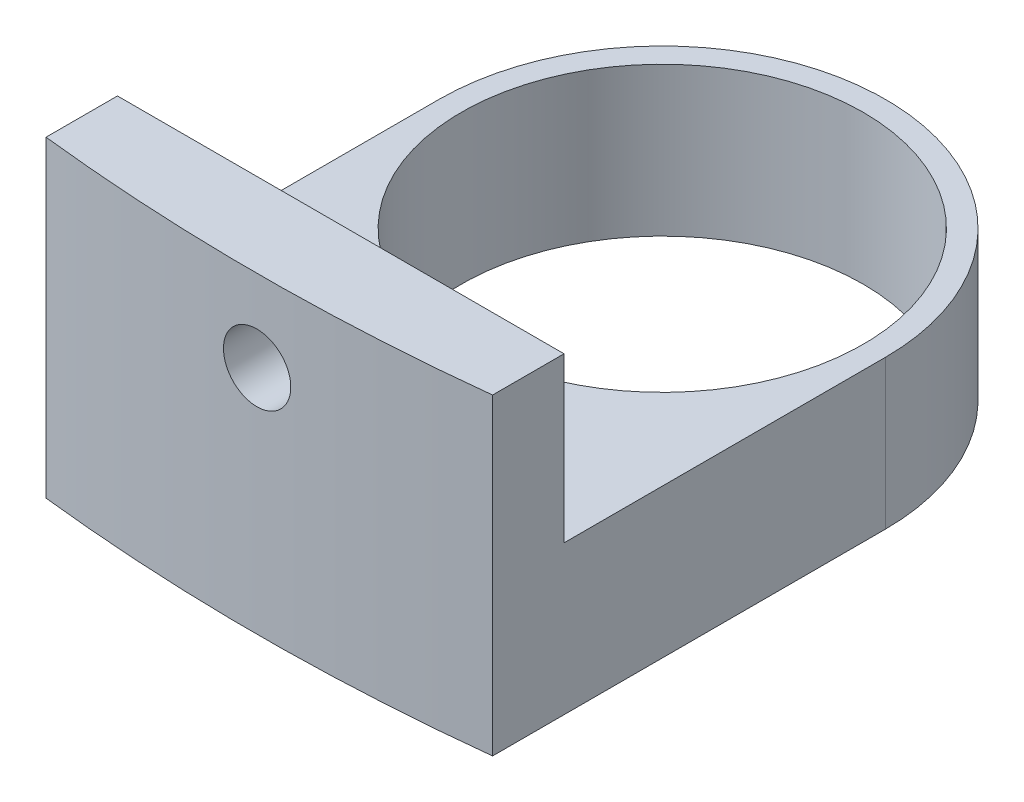
ISO-10303-21;
HEADER;
FILE_DESCRIPTION(('STEP AP214'),'2;1');
FILE_NAME('part.step','',(''),(''),'','','');
FILE_SCHEMA(('AUTOMOTIVE_DESIGN { 1 0 10303 214 1 1 1 1 }'));
ENDSEC;
DATA;
#1=APPLICATION_CONTEXT('core data for automotive mechanical design processes');
#2=APPLICATION_PROTOCOL_DEFINITION('international standard','automotive_design',2000,#1);
#3=PRODUCT_CONTEXT('',#1,'mechanical');
#4=PRODUCT('Part','Part','',(#3));
#5=PRODUCT_RELATED_PRODUCT_CATEGORY('part','',(#4));
#6=PRODUCT_DEFINITION_FORMATION('','',#4);
#7=PRODUCT_DEFINITION_CONTEXT('part definition',#1,'design');
#8=PRODUCT_DEFINITION('design','',#6,#7);
#9=PRODUCT_DEFINITION_SHAPE('','',#8);
#10=(LENGTH_UNIT() NAMED_UNIT(*) SI_UNIT(.MILLI.,.METRE.));
#11=(NAMED_UNIT(*) PLANE_ANGLE_UNIT() SI_UNIT($,.RADIAN.));
#12=(NAMED_UNIT(*) SI_UNIT($,.STERADIAN.) SOLID_ANGLE_UNIT());
#13=UNCERTAINTY_MEASURE_WITH_UNIT(LENGTH_MEASURE(1.E-05),#10,'distance_accuracy_value','');
#14=(GEOMETRIC_REPRESENTATION_CONTEXT(3) GLOBAL_UNCERTAINTY_ASSIGNED_CONTEXT((#13)) GLOBAL_UNIT_ASSIGNED_CONTEXT((#10,
#11,#12)) REPRESENTATION_CONTEXT('',''));
#15=CARTESIAN_POINT('',(0.,0.,0.));
#16=DIRECTION('',(0.,0.,1.));
#17=DIRECTION('',(1.,0.,0.));
#18=AXIS2_PLACEMENT_3D('',#15,#16,#17);
#19=CARTESIAN_POINT('',(0.,3.175,0.));
#20=DIRECTION('',(0.,1.,0.));
#21=DIRECTION('',(0.,0.,1.));
#22=AXIS2_PLACEMENT_3D('',#19,#20,#21);
#23=PLANE('',#22);
#24=CARTESIAN_POINT('',(0.,3.175,0.));
#25=DIRECTION('',(0.,1.,0.));
#26=DIRECTION('',(0.,0.,1.));
#27=AXIS2_PLACEMENT_3D('',#24,#25,#26);
#28=CIRCLE('',#27,8.5725);
#29=CARTESIAN_POINT('',(0.,3.175,8.5725));
#30=VERTEX_POINT('',#29);
#31=EDGE_CURVE('E169',#30,#30,#28,.T.);
#32=ORIENTED_EDGE('',*,*,#31,.F.);
#33=EDGE_LOOP('',(#32));
#34=FACE_BOUND('',#33,.T.);
#35=DIRECTION('',(0.,0.,1.));
#36=VECTOR('',#35,1.);
#37=CARTESIAN_POINT('',(-9.525,3.175,0.));
#38=LINE('',#37,#36);
#39=CARTESIAN_POINT('',(-9.525,3.175,0.));
#40=VERTEX_POINT('',#39);
#41=CARTESIAN_POINT('',(-9.525,3.175,13.716));
#42=VERTEX_POINT('',#41);
#43=EDGE_CURVE('E54',#40,#42,#38,.T.);
#44=ORIENTED_EDGE('',*,*,#43,.T.);
#45=DIRECTION('',(1.,0.,0.));
#46=VECTOR('',#45,1.);
#47=CARTESIAN_POINT('',(0.,3.175,13.716));
#48=LINE('',#47,#46);
#49=CARTESIAN_POINT('',(9.525,3.175,13.716));
#50=VERTEX_POINT('',#49);
#51=EDGE_CURVE('E58',#42,#50,#48,.T.);
#52=ORIENTED_EDGE('',*,*,#51,.T.);
#53=DIRECTION('',(0.,0.,-1.));
#54=VECTOR('',#53,1.);
#55=CARTESIAN_POINT('',(9.525,3.175,16.764));
#56=LINE('',#55,#54);
#57=CARTESIAN_POINT('',(9.525,3.175,0.));
#58=VERTEX_POINT('',#57);
#59=EDGE_CURVE('E148',#50,#58,#56,.T.);
#60=ORIENTED_EDGE('',*,*,#59,.T.);
#61=CARTESIAN_POINT('',(0.,3.175,0.));
#62=DIRECTION('',(0.,1.,0.));
#63=DIRECTION('',(0.,0.,1.));
#64=AXIS2_PLACEMENT_3D('',#61,#62,#63);
#65=CIRCLE('',#64,9.525);
#66=EDGE_CURVE('E11',#58,#40,#65,.T.);
#67=ORIENTED_EDGE('',*,*,#66,.T.);
#68=EDGE_LOOP('',(#44,#52,#60,#67));
#69=FACE_BOUND('',#68,.T.);
#70=ADVANCED_FACE('F39',(#34,#69),#23,.T.);
#71=CARTESIAN_POINT('',(0.,3.175,0.));
#72=DIRECTION('',(0.,-1.,0.));
#73=DIRECTION('',(0.,0.,-1.));
#74=AXIS2_PLACEMENT_3D('',#71,#72,#73);
#75=CYLINDRICAL_SURFACE('',#74,9.525);
#76=DIRECTION('',(0.,-1.,0.));
#77=VECTOR('',#76,1.);
#78=CARTESIAN_POINT('',(-9.525,3.175,0.));
#79=LINE('',#78,#77);
#80=CARTESIAN_POINT('',(-9.525,-3.175,0.));
#81=VERTEX_POINT('',#80);
#82=EDGE_CURVE('E164',#40,#81,#79,.T.);
#83=ORIENTED_EDGE('',*,*,#82,.F.);
#84=ORIENTED_EDGE('',*,*,#66,.F.);
#85=DIRECTION('',(0.,-1.,0.));
#86=VECTOR('',#85,1.);
#87=CARTESIAN_POINT('',(9.525,3.175,0.));
#88=LINE('',#87,#86);
#89=CARTESIAN_POINT('',(9.525,-3.175,0.));
#90=VERTEX_POINT('',#89);
#91=EDGE_CURVE('E103',#58,#90,#88,.T.);
#92=ORIENTED_EDGE('',*,*,#91,.T.);
#93=CARTESIAN_POINT('',(0.,-3.175,0.));
#94=DIRECTION('',(0.,1.,0.));
#95=DIRECTION('',(0.,0.,1.));
#96=AXIS2_PLACEMENT_3D('',#93,#94,#95);
#97=CIRCLE('',#96,9.525);
#98=EDGE_CURVE('E43',#90,#81,#97,.T.);
#99=ORIENTED_EDGE('',*,*,#98,.T.);
#100=EDGE_LOOP('',(#83,#84,#92,#99));
#101=FACE_BOUND('',#100,.T.);
#102=ADVANCED_FACE('F41',(#101),#75,.T.);
#103=CARTESIAN_POINT('',(0.,-3.175,0.));
#104=DIRECTION('',(0.,1.,0.));
#105=DIRECTION('',(0.,0.,1.));
#106=AXIS2_PLACEMENT_3D('',#103,#104,#105);
#107=PLANE('',#106);
#108=ORIENTED_EDGE('',*,*,#98,.F.);
#109=DIRECTION('',(0.,0.,-1.));
#110=VECTOR('',#109,1.);
#111=CARTESIAN_POINT('',(9.525,-3.175,16.764));
#112=LINE('',#111,#110);
#113=CARTESIAN_POINT('',(9.52500000000004,-3.175,16.764));
#114=VERTEX_POINT('',#113);
#115=EDGE_CURVE('E149',#114,#90,#112,.T.);
#116=ORIENTED_EDGE('',*,*,#115,.F.);
#117=CARTESIAN_POINT('',(0.,-3.175,-68.430189942742));
#118=DIRECTION('',(0.,1.,0.));
#119=DIRECTION('',(0.,0.,1.));
#120=AXIS2_PLACEMENT_3D('',#117,#118,#119);
#121=CIRCLE('',#120,85.725);
#122=CARTESIAN_POINT('',(-9.525,-3.175,16.764));
#123=VERTEX_POINT('',#122);
#124=EDGE_CURVE('E97',#123,#114,#121,.T.);
#125=ORIENTED_EDGE('',*,*,#124,.F.);
#126=DIRECTION('',(0.,0.,1.));
#127=VECTOR('',#126,1.);
#128=CARTESIAN_POINT('',(-9.525,-3.175,0.));
#129=LINE('',#128,#127);
#130=EDGE_CURVE('E145',#81,#123,#129,.T.);
#131=ORIENTED_EDGE('',*,*,#130,.F.);
#132=EDGE_LOOP('',(#108,#116,#125,#131));
#133=FACE_BOUND('',#132,.T.);
#134=CARTESIAN_POINT('',(0.,-3.175,0.));
#135=DIRECTION('',(0.,1.,0.));
#136=DIRECTION('',(0.,0.,1.));
#137=AXIS2_PLACEMENT_3D('',#134,#135,#136);
#138=CIRCLE('',#137,8.5725);
#139=CARTESIAN_POINT('',(0.,-3.175,8.5725));
#140=VERTEX_POINT('',#139);
#141=EDGE_CURVE('E168',#140,#140,#138,.T.);
#142=ORIENTED_EDGE('',*,*,#141,.T.);
#143=EDGE_LOOP('',(#142));
#144=FACE_BOUND('',#143,.T.);
#145=ADVANCED_FACE('F177',(#133,#144),#107,.F.);
#146=CARTESIAN_POINT('',(0.,3.175,0.));
#147=DIRECTION('',(0.,-1.,0.));
#148=DIRECTION('',(0.,0.,-1.));
#149=AXIS2_PLACEMENT_3D('',#146,#147,#148);
#150=CYLINDRICAL_SURFACE('',#149,8.5725);
#151=ORIENTED_EDGE('',*,*,#31,.T.);
#152=EDGE_LOOP('',(#151));
#153=FACE_BOUND('',#152,.T.);
#154=ORIENTED_EDGE('',*,*,#141,.F.);
#155=EDGE_LOOP('',(#154));
#156=FACE_BOUND('',#155,.T.);
#157=ADVANCED_FACE('F179',(#153,#156),#150,.F.);
#158=CARTESIAN_POINT('',(-9.525,3.175,0.));
#159=DIRECTION('',(1.,0.,0.));
#160=DIRECTION('',(0.,0.,-1.));
#161=AXIS2_PLACEMENT_3D('',#158,#159,#160);
#162=PLANE('',#161);
#163=DIRECTION('',(0.,-1.,0.));
#164=VECTOR('',#163,1.);
#165=CARTESIAN_POINT('',(-9.525,3.175,16.764));
#166=LINE('',#165,#164);
#167=CARTESIAN_POINT('',(-9.525,10.16,16.764));
#168=VERTEX_POINT('',#167);
#169=EDGE_CURVE('E102',#168,#123,#166,.T.);
#170=ORIENTED_EDGE('',*,*,#169,.F.);
#171=DIRECTION('',(0.,0.,1.));
#172=VECTOR('',#171,1.);
#173=CARTESIAN_POINT('',(-9.525,10.16,16.764));
#174=LINE('',#173,#172);
#175=CARTESIAN_POINT('',(-9.525,10.16,13.716));
#176=VERTEX_POINT('',#175);
#177=EDGE_CURVE('E118',#176,#168,#174,.T.);
#178=ORIENTED_EDGE('',*,*,#177,.F.);
#179=DIRECTION('',(0.,-1.,0.));
#180=VECTOR('',#179,1.);
#181=CARTESIAN_POINT('',(-9.525,10.16,13.716));
#182=LINE('',#181,#180);
#183=EDGE_CURVE('E137',#176,#42,#182,.T.);
#184=ORIENTED_EDGE('',*,*,#183,.T.);
#185=ORIENTED_EDGE('',*,*,#43,.F.);
#186=ORIENTED_EDGE('',*,*,#82,.T.);
#187=ORIENTED_EDGE('',*,*,#130,.T.);
#188=EDGE_LOOP('',(#170,#178,#184,#185,#186,#187));
#189=FACE_BOUND('',#188,.T.);
#190=ADVANCED_FACE('F181',(#189),#162,.F.);
#191=CARTESIAN_POINT('',(0.,3.175,-68.430189942742));
#192=DIRECTION('',(0.,-1.,0.));
#193=DIRECTION('',(0.,0.,-1.));
#194=AXIS2_PLACEMENT_3D('',#191,#192,#193);
#195=CYLINDRICAL_SURFACE('',#194,85.725);
#196=CARTESIAN_POINT('',(-1.43509999999998,6.6675,17.2827968970013));
#197=CARTESIAN_POINT('',(-1.43509642744037,6.74810413701187,17.282797059359));
#198=CARTESIAN_POINT('',(-1.42828636713136,6.82876657587506,17.2829118177657));
#199=CARTESIAN_POINT('',(-1.40121442033303,6.98786955228493,17.2833585741748));
#200=CARTESIAN_POINT('',(-1.38093638080943,7.06630730368348,17.2836908330328));
#201=CARTESIAN_POINT('',(-1.32750627948502,7.2186329050849,17.2845349409811));
#202=CARTESIAN_POINT('',(-1.29436041322973,7.29252292490474,17.2850467036333));
#203=CARTESIAN_POINT('',(-1.2161441759634,7.43366891934467,17.2861920426631));
#204=CARTESIAN_POINT('',(-1.17107675319424,7.50092652854502,17.2868255889126));
#205=CARTESIAN_POINT('',(-1.07028292683959,7.62693565936056,17.2881432923671));
#206=CARTESIAN_POINT('',(-1.01455447642584,7.68568554375187,17.2888274592753));
#207=CARTESIAN_POINT('',(-0.894023155290659,7.7929980764986,17.2901692040067));
#208=CARTESIAN_POINT('',(-0.82921992681968,7.84156032304424,17.2908267807802));
#209=CARTESIAN_POINT('',(-0.692376911374749,7.92711818941459,17.2920412120393));
#210=CARTESIAN_POINT('',(-0.620336834646382,7.96411334586331,17.2925980624894));
#211=CARTESIAN_POINT('',(-0.471067248773182,8.02548364175931,17.2935482260147));
#212=CARTESIAN_POINT('',(-0.393837753290994,8.04985881443089,17.2939415395205));
#213=CARTESIAN_POINT('',(-0.236389152602276,8.08529512547048,17.2945202568447));
#214=CARTESIAN_POINT('',(-0.156170326454681,8.09635750341581,17.2947056800201));
#215=CARTESIAN_POINT('',(0.00498599157297291,8.10485800433765,17.2948477774311));
#216=CARTESIAN_POINT('',(0.0859234816678218,8.10229616114819,17.2948044522349));
#217=CARTESIAN_POINT('',(0.246211175952106,8.08362204344327,17.2944939546854));
#218=CARTESIAN_POINT('',(0.325561537924182,8.06751112281858,17.2942268046978));
#219=CARTESIAN_POINT('',(0.480431158372986,8.02219826539567,17.2934987988387));
#220=CARTESIAN_POINT('',(0.555950411437976,7.99299631010591,17.2930379426935));
#221=CARTESIAN_POINT('',(0.701018352349746,7.92232877927317,17.2919744386534));
#222=CARTESIAN_POINT('',(0.770566737764403,7.88086258300291,17.2913717835821));
#223=CARTESIAN_POINT('',(0.901715350860963,7.78684414011145,17.2900926182007));
#224=CARTESIAN_POINT('',(0.963315575100068,7.73429188868828,17.2894161078588));
#225=CARTESIAN_POINT('',(1.07682716958276,7.61958542839036,17.2880653955095));
#226=CARTESIAN_POINT('',(1.12873734893752,7.55743004102106,17.2873911937959));
#227=CARTESIAN_POINT('',(1.2213861259491,7.42528586070077,17.2861211931043));
#228=CARTESIAN_POINT('',(1.26212472204743,7.35529706665696,17.2855253941372));
#229=CARTESIAN_POINT('',(1.33127374607705,7.20947219037048,17.284479379533));
#230=CARTESIAN_POINT('',(1.35968413816215,7.1336360911266,17.2840291643192));
#231=CARTESIAN_POINT('',(1.40336951889482,6.97826964847395,17.2833250963887));
#232=CARTESIAN_POINT('',(1.41864451908694,6.89873930831207,17.2830712434993));
#233=CARTESIAN_POINT('',(1.43562405287623,6.73825234587494,17.2827885512906));
#234=CARTESIAN_POINT('',(1.43733023393062,6.6572958979467,17.2827596846545));
#235=CARTESIAN_POINT('',(1.42712798705907,6.49624573160779,17.2829301482977));
#236=CARTESIAN_POINT('',(1.41521956361891,6.41615201291287,17.2831294785018));
#237=CARTESIAN_POINT('',(1.37812751285265,6.25910549915147,17.2837338388108));
#238=CARTESIAN_POINT('',(1.3529446317432,6.18215252779151,17.284138857353));
#239=CARTESIAN_POINT('',(1.29001928833263,6.03356656145481,17.2851089232277));
#240=CARTESIAN_POINT('',(1.25227681927452,5.96193356934022,17.2856739706463));
#241=CARTESIAN_POINT('',(1.16529943990542,5.82601340276757,17.2869004584638));
#242=CARTESIAN_POINT('',(1.116063419914,5.76172693849602,17.2875619081678));
#243=CARTESIAN_POINT('',(1.0074982101096,5.64233182897212,17.2889065966779));
#244=CARTESIAN_POINT('',(0.948169009470809,5.58722319356391,17.2895898355072));
#245=CARTESIAN_POINT('',(0.82109455429866,5.48774262926531,17.2909011541897));
#246=CARTESIAN_POINT('',(0.753348466772983,5.44337176434066,17.2915292285729));
#247=CARTESIAN_POINT('',(0.611367651016459,5.36663359054703,17.292659332774));
#248=CARTESIAN_POINT('',(0.537132932061625,5.3342662645184,17.293161362772));
#249=CARTESIAN_POINT('',(0.384286141291226,5.28245580059694,17.2939827551306));
#250=CARTESIAN_POINT('',(0.305674304884225,5.26301196838362,17.2943021273045));
#251=CARTESIAN_POINT('',(0.146301370703151,5.23759814511923,17.2947222381127));
#252=CARTESIAN_POINT('',(0.065540270847642,5.23162816711728,17.2948229765352));
#253=CARTESIAN_POINT('',(-0.0958278089111777,5.23333164063179,17.2947944627551));
#254=CARTESIAN_POINT('',(-0.176434806686429,5.24100340016486,17.2946652390747));
#255=CARTESIAN_POINT('',(-0.335216663689761,5.26976912796573,17.2941914230945));
#256=CARTESIAN_POINT('',(-0.413391518046357,5.2908631231159,17.2938468303633));
#257=CARTESIAN_POINT('',(-0.565091469551503,5.34587464296667,17.2929811093114));
#258=CARTESIAN_POINT('',(-0.638616481658109,5.37979240212466,17.2924599777631));
#259=CARTESIAN_POINT('',(-0.77892613076261,5.45948706424411,17.2912999402033));
#260=CARTESIAN_POINT('',(-0.845711025767851,5.50526351302312,17.2906610387026));
#261=CARTESIAN_POINT('',(-0.970650066815367,5.6073772852806,17.2893374362849));
#262=CARTESIAN_POINT('',(-1.02880406080585,5.66371479477519,17.2886527345613));
#263=CARTESIAN_POINT('',(-1.1348435426314,5.78536975430644,17.2873145442974));
#264=CARTESIAN_POINT('',(-1.18272647766626,5.85068943019318,17.2866610635481));
#265=CARTESIAN_POINT('',(-1.26686734972215,5.98847029565579,17.2854588579989));
#266=CARTESIAN_POINT('',(-1.30311910705953,6.06093525490476,17.2849101889482));
#267=CARTESIAN_POINT('',(-1.36290022244651,6.21086720890819,17.2839805912493));
#268=CARTESIAN_POINT('',(-1.38644480722323,6.28832809193406,17.2835994619439));
#269=CARTESIAN_POINT('',(-1.41387916033306,6.41648440970082,17.2831501731322));
#270=CARTESIAN_POINT('',(-1.42182701835092,6.4663473852985,17.2830182667988));
#271=CARTESIAN_POINT('',(-1.43243855586699,6.56663262888219,17.2828415779325));
#272=CARTESIAN_POINT('',(-1.43510223584227,6.61705489681769,17.2827967953917));
#273=CARTESIAN_POINT('',(-1.43509999999998,6.6675,17.2827968970013));
#274=B_SPLINE_CURVE_WITH_KNOTS('',3,(#196,#197,#198,#199,#200,#201,#202,#203,#204,#205,#206,
#207,#208,#209,#210,#211,#212,#213,#214,#215,#216,#217,#218,#219,#220,#221,#222,#223,#224,#225,
#226,#227,#228,#229,#230,#231,#232,#233,#234,#235,#236,#237,#238,#239,#240,#241,#242,#243,#244,
#245,#246,#247,#248,#249,#250,#251,#252,#253,#254,#255,#256,#257,#258,#259,#260,#261,#262,#263,
#264,#265,#266,#267,#268,#269,#270,#271,#272,#273),.UNSPECIFIED.,.T.,.F.,(4,2,2,2,2,2,2,2,2,2,2,
2,2,2,2,2,2,2,2,2,2,2,2,2,2,2,2,2,2,2,2,2,2,2,2,2,2,2,4),(0.,0.241628284463965,
0.483546894234303,0.725349170249637,0.967091703545706,1.20888069605322,1.45067922314845,
1.69248743541792,1.93429501108225,2.17608006988307,2.41786452824134,2.65962482917174,
2.9013854715978,3.14315835229554,3.38493133771846,3.62673401706558,3.86853673014558,
4.11034014630038,4.3521433499367,4.59391719460588,4.83569095961472,5.07745113488777,
5.31921144022653,5.56099509672275,5.80277901255467,6.04458687605511,6.28639439387767,
6.52818891943266,6.76998367915996,7.01174845119849,7.25351370745076,7.49528338412072,
7.73704380248993,7.9788084794807,8.22063317595227,8.46258614274782,8.70424853522958,
8.85546862508987,9.00668870129704),.UNSPECIFIED.);
#275=CARTESIAN_POINT('',(-1.43509999999998,6.6675,17.2827968970013));
#276=VERTEX_POINT('',#275);
#277=EDGE_CURVE('E120',#276,#276,#274,.T.);
#278=ORIENTED_EDGE('',*,*,#277,.T.);
#279=EDGE_LOOP('',(#278));
#280=FACE_BOUND('',#279,.T.);
#281=ORIENTED_EDGE('',*,*,#169,.T.);
#282=ORIENTED_EDGE('',*,*,#124,.T.);
#283=DIRECTION('',(0.,-1.,0.));
#284=VECTOR('',#283,1.);
#285=CARTESIAN_POINT('',(9.52500000000004,3.175,16.764));
#286=LINE('',#285,#284);
#287=CARTESIAN_POINT('',(9.52500000000004,10.16,16.764));
#288=VERTEX_POINT('',#287);
#289=EDGE_CURVE('E91',#288,#114,#286,.T.);
#290=ORIENTED_EDGE('',*,*,#289,.F.);
#291=CARTESIAN_POINT('',(0.,10.16,-68.430189942742));
#292=DIRECTION('',(0.,1.,0.));
#293=DIRECTION('',(0.,0.,1.));
#294=AXIS2_PLACEMENT_3D('',#291,#292,#293);
#295=CIRCLE('',#294,85.725);
#296=EDGE_CURVE('E95',#168,#288,#295,.T.);
#297=ORIENTED_EDGE('',*,*,#296,.F.);
#298=EDGE_LOOP('',(#281,#282,#290,#297));
#299=FACE_BOUND('',#298,.T.);
#300=ADVANCED_FACE('F93',(#280,#299),#195,.T.);
#301=CARTESIAN_POINT('',(9.525,3.175,16.764));
#302=DIRECTION('',(-1.,0.,0.));
#303=DIRECTION('',(0.,0.,1.));
#304=AXIS2_PLACEMENT_3D('',#301,#302,#303);
#305=PLANE('',#304);
#306=ORIENTED_EDGE('',*,*,#59,.F.);
#307=DIRECTION('',(0.,-1.,0.));
#308=VECTOR('',#307,1.);
#309=CARTESIAN_POINT('',(9.52500000000004,10.16,13.716));
#310=LINE('',#309,#308);
#311=CARTESIAN_POINT('',(9.52500000000004,10.16,13.716));
#312=VERTEX_POINT('',#311);
#313=EDGE_CURVE('E109',#312,#50,#310,.T.);
#314=ORIENTED_EDGE('',*,*,#313,.F.);
#315=DIRECTION('',(0.,0.,-1.));
#316=VECTOR('',#315,1.);
#317=CARTESIAN_POINT('',(9.52500000000004,10.16,13.716));
#318=LINE('',#317,#316);
#319=EDGE_CURVE('E106',#288,#312,#318,.T.);
#320=ORIENTED_EDGE('',*,*,#319,.F.);
#321=ORIENTED_EDGE('',*,*,#289,.T.);
#322=ORIENTED_EDGE('',*,*,#115,.T.);
#323=ORIENTED_EDGE('',*,*,#91,.F.);
#324=EDGE_LOOP('',(#306,#314,#320,#321,#322,#323));
#325=FACE_BOUND('',#324,.T.);
#326=ADVANCED_FACE('F107',(#325),#305,.F.);
#327=CARTESIAN_POINT('',(-9.525,10.16,13.716));
#328=DIRECTION('',(0.,0.,1.));
#329=DIRECTION('',(1.,0.,0.));
#330=AXIS2_PLACEMENT_3D('',#327,#328,#329);
#331=PLANE('',#330);
#332=CARTESIAN_POINT('',(0.,6.6675,13.716));
#333=DIRECTION('',(0.,0.,-1.));
#334=DIRECTION('',(-1.,0.,0.));
#335=AXIS2_PLACEMENT_3D('',#332,#333,#334);
#336=CIRCLE('',#335,1.4351);
#337=CARTESIAN_POINT('',(-1.43509999999998,6.6675,13.716));
#338=VERTEX_POINT('',#337);
#339=EDGE_CURVE('E124',#338,#338,#336,.T.);
#340=ORIENTED_EDGE('',*,*,#339,.F.);
#341=EDGE_LOOP('',(#340));
#342=FACE_BOUND('',#341,.T.);
#343=ORIENTED_EDGE('',*,*,#51,.F.);
#344=ORIENTED_EDGE('',*,*,#183,.F.);
#345=DIRECTION('',(-1.,0.,0.));
#346=VECTOR('',#345,1.);
#347=CARTESIAN_POINT('',(-9.525,10.16,13.716));
#348=LINE('',#347,#346);
#349=EDGE_CURVE('E113',#312,#176,#348,.T.);
#350=ORIENTED_EDGE('',*,*,#349,.F.);
#351=ORIENTED_EDGE('',*,*,#313,.T.);
#352=EDGE_LOOP('',(#343,#344,#350,#351));
#353=FACE_BOUND('',#352,.T.);
#354=ADVANCED_FACE('F206',(#342,#353),#331,.F.);
#355=CARTESIAN_POINT('',(0.,10.16,-68.430189942742));
#356=DIRECTION('',(0.,1.,0.));
#357=DIRECTION('',(0.,0.,1.));
#358=AXIS2_PLACEMENT_3D('',#355,#356,#357);
#359=PLANE('',#358);
#360=ORIENTED_EDGE('',*,*,#296,.T.);
#361=ORIENTED_EDGE('',*,*,#319,.T.);
#362=ORIENTED_EDGE('',*,*,#349,.T.);
#363=ORIENTED_EDGE('',*,*,#177,.T.);
#364=EDGE_LOOP('',(#360,#361,#362,#363));
#365=FACE_BOUND('',#364,.T.);
#366=ADVANCED_FACE('F116',(#365),#359,.T.);
#367=CARTESIAN_POINT('',(0.,6.6675,32.766));
#368=DIRECTION('',(0.,0.,-1.));
#369=DIRECTION('',(-1.,0.,0.));
#370=AXIS2_PLACEMENT_3D('',#367,#368,#369);
#371=CYLINDRICAL_SURFACE('',#370,1.4351);
#372=ORIENTED_EDGE('',*,*,#339,.T.);
#373=EDGE_LOOP('',(#372));
#374=FACE_BOUND('',#373,.T.);
#375=ORIENTED_EDGE('',*,*,#277,.F.);
#376=EDGE_LOOP('',(#375));
#377=FACE_BOUND('',#376,.T.);
#378=ADVANCED_FACE('F214',(#374,#377),#371,.F.);
#379=CLOSED_SHELL('',(#70,#102,#145,#157,#190,#300,#326,#354,#366,#378));
#380=MANIFOLD_SOLID_BREP('B2',#379);
#381=ADVANCED_BREP_SHAPE_REPRESENTATION('',(#18,#380),#14);
#382=SHAPE_DEFINITION_REPRESENTATION(#9,#381);
ENDSEC;
END-ISO-10303-21;
